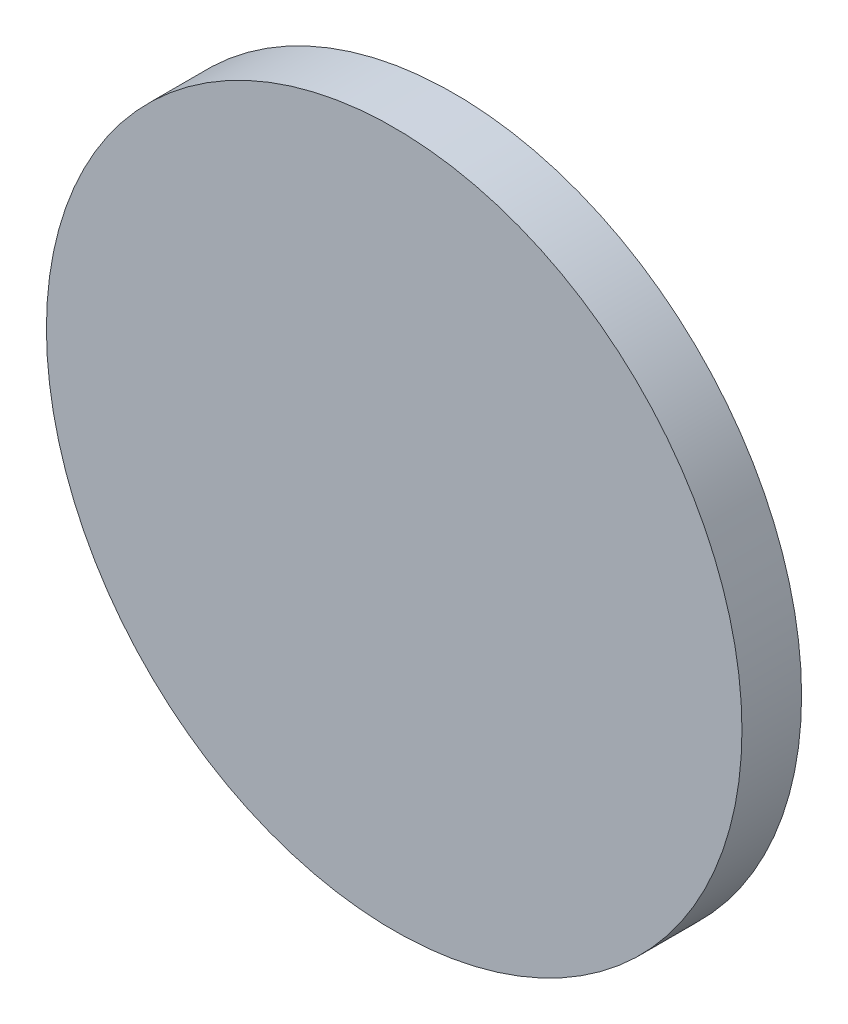
ISO-10303-21;
HEADER;
FILE_DESCRIPTION(('STEP AP214'),'2;1');
FILE_NAME('part.step','',(''),(''),'','','');
FILE_SCHEMA(('AUTOMOTIVE_DESIGN { 1 0 10303 214 1 1 1 1 }'));
ENDSEC;
DATA;
#1=APPLICATION_CONTEXT('core data for automotive mechanical design processes');
#2=APPLICATION_PROTOCOL_DEFINITION('international standard','automotive_design',2000,#1);
#3=PRODUCT_CONTEXT('',#1,'mechanical');
#4=PRODUCT('Part','Part','',(#3));
#5=PRODUCT_RELATED_PRODUCT_CATEGORY('part','',(#4));
#6=PRODUCT_DEFINITION_FORMATION('','',#4);
#7=PRODUCT_DEFINITION_CONTEXT('part definition',#1,'design');
#8=PRODUCT_DEFINITION('design','',#6,#7);
#9=PRODUCT_DEFINITION_SHAPE('','',#8);
#10=(LENGTH_UNIT() NAMED_UNIT(*) SI_UNIT(.MILLI.,.METRE.));
#11=(NAMED_UNIT(*) PLANE_ANGLE_UNIT() SI_UNIT($,.RADIAN.));
#12=(NAMED_UNIT(*) SI_UNIT($,.STERADIAN.) SOLID_ANGLE_UNIT());
#13=UNCERTAINTY_MEASURE_WITH_UNIT(LENGTH_MEASURE(1.E-05),#10,'distance_accuracy_value','');
#14=(GEOMETRIC_REPRESENTATION_CONTEXT(3) GLOBAL_UNCERTAINTY_ASSIGNED_CONTEXT((#13)) GLOBAL_UNIT_ASSIGNED_CONTEXT((#10,
#11,#12)) REPRESENTATION_CONTEXT('',''));
#15=CARTESIAN_POINT('',(0.,0.,0.));
#16=DIRECTION('',(0.,0.,1.));
#17=DIRECTION('',(1.,0.,0.));
#18=AXIS2_PLACEMENT_3D('',#15,#16,#17);
#19=CARTESIAN_POINT('',(11.428,3.748000014875,0.));
#20=DIRECTION('',(0.,0.,-1.));
#21=DIRECTION('',(-1.,0.,0.));
#22=AXIS2_PLACEMENT_3D('',#19,#20,#21);
#23=PLANE('',#22);
#24=CARTESIAN_POINT('',(11.428,3.748000014875,0.));
#25=DIRECTION('',(0.,0.,1.));
#26=DIRECTION('',(1.,0.,0.));
#27=AXIS2_PLACEMENT_3D('',#24,#25,#26);
#28=CIRCLE('',#27,0.200024667);
#29=CARTESIAN_POINT('',(11.628024667,3.748000014875,0.));
#30=VERTEX_POINT('',#29);
#31=EDGE_CURVE('E18',#30,#30,#28,.T.);
#32=ORIENTED_EDGE('',*,*,#31,.F.);
#33=EDGE_LOOP('',(#32));
#34=FACE_BOUND('',#33,.T.);
#35=ADVANCED_FACE('F15',(#34),#23,.T.);
#36=CARTESIAN_POINT('',(11.428,3.748000014875,0.));
#37=DIRECTION('',(0.,0.,1.));
#38=DIRECTION('',(1.,0.,0.));
#39=AXIS2_PLACEMENT_3D('',#36,#37,#38);
#40=CYLINDRICAL_SURFACE('',#39,0.200024667);
#41=CARTESIAN_POINT('',(11.428,3.748000014875,0.03429));
#42=DIRECTION('',(0.,0.,1.));
#43=DIRECTION('',(1.,0.,0.));
#44=AXIS2_PLACEMENT_3D('',#41,#42,#43);
#45=CIRCLE('',#44,0.200024667);
#46=CARTESIAN_POINT('',(11.628024667,3.748000014875,0.03429));
#47=VERTEX_POINT('',#46);
#48=EDGE_CURVE('E10',#47,#47,#45,.T.);
#49=ORIENTED_EDGE('',*,*,#48,.F.);
#50=EDGE_LOOP('',(#49));
#51=FACE_BOUND('',#50,.T.);
#52=ORIENTED_EDGE('',*,*,#31,.T.);
#53=EDGE_LOOP('',(#52));
#54=FACE_BOUND('',#53,.T.);
#55=ADVANCED_FACE('F27',(#51,#54),#40,.T.);
#56=CARTESIAN_POINT('',(11.428,3.748000014875,0.03429));
#57=DIRECTION('',(0.,0.,1.));
#58=DIRECTION('',(1.,0.,0.));
#59=AXIS2_PLACEMENT_3D('',#56,#57,#58);
#60=PLANE('',#59);
#61=ORIENTED_EDGE('',*,*,#48,.T.);
#62=EDGE_LOOP('',(#61));
#63=FACE_BOUND('',#62,.T.);
#64=ADVANCED_FACE('F34',(#63),#60,.T.);
#65=CLOSED_SHELL('',(#35,#55,#64));
#66=MANIFOLD_SOLID_BREP('B1',#65);
#67=ADVANCED_BREP_SHAPE_REPRESENTATION('',(#18,#66),#14);
#68=SHAPE_DEFINITION_REPRESENTATION(#9,#67);
ENDSEC;
END-ISO-10303-21;
